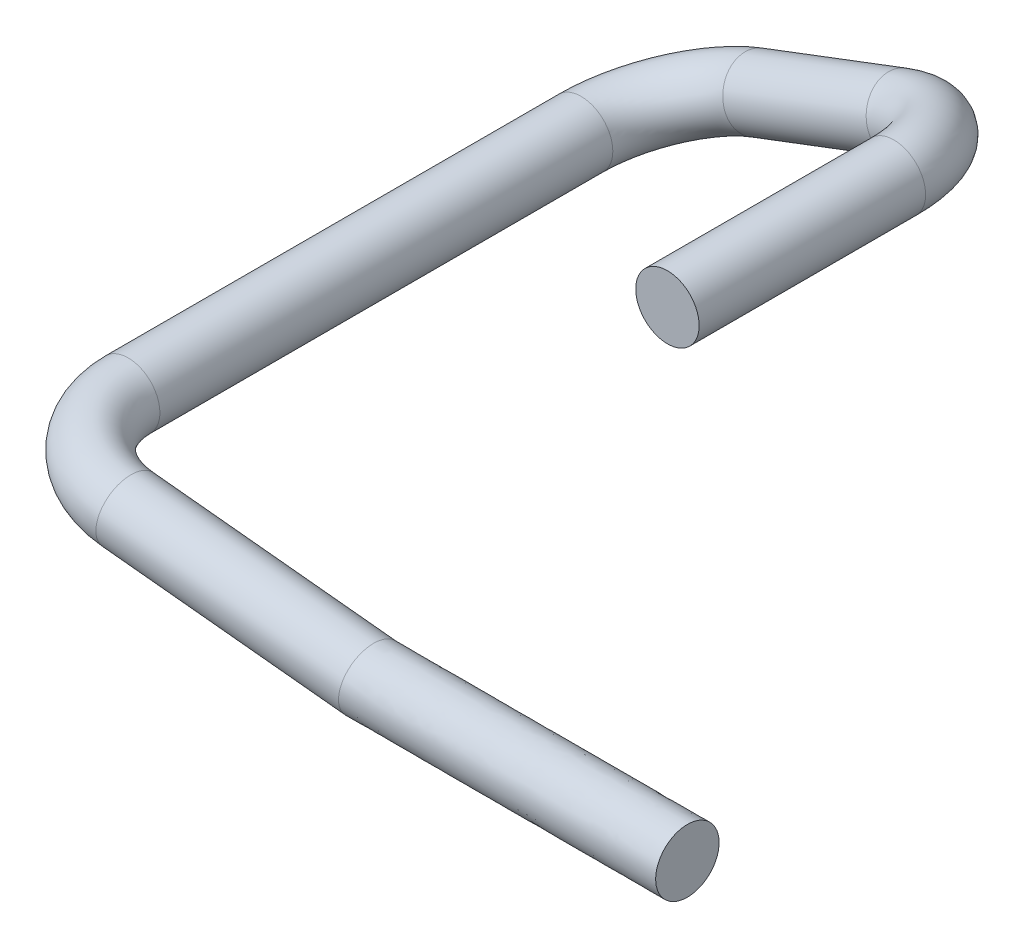
ISO-10303-21;
HEADER;
FILE_DESCRIPTION(('STEP AP214'),'2;1');
FILE_NAME('part.step','',(''),(''),'','','');
FILE_SCHEMA(('AUTOMOTIVE_DESIGN { 1 0 10303 214 1 1 1 1 }'));
ENDSEC;
DATA;
#1=APPLICATION_CONTEXT('core data for automotive mechanical design processes');
#2=APPLICATION_PROTOCOL_DEFINITION('international standard','automotive_design',2000,#1);
#3=PRODUCT_CONTEXT('',#1,'mechanical');
#4=PRODUCT('Part','Part','',(#3));
#5=PRODUCT_RELATED_PRODUCT_CATEGORY('part','',(#4));
#6=PRODUCT_DEFINITION_FORMATION('','',#4);
#7=PRODUCT_DEFINITION_CONTEXT('part definition',#1,'design');
#8=PRODUCT_DEFINITION('design','',#6,#7);
#9=PRODUCT_DEFINITION_SHAPE('','',#8);
#10=(LENGTH_UNIT() NAMED_UNIT(*) SI_UNIT(.MILLI.,.METRE.));
#11=(NAMED_UNIT(*) PLANE_ANGLE_UNIT() SI_UNIT($,.RADIAN.));
#12=(NAMED_UNIT(*) SI_UNIT($,.STERADIAN.) SOLID_ANGLE_UNIT());
#13=UNCERTAINTY_MEASURE_WITH_UNIT(LENGTH_MEASURE(1.E-05),#10,'distance_accuracy_value','');
#14=(GEOMETRIC_REPRESENTATION_CONTEXT(3) GLOBAL_UNCERTAINTY_ASSIGNED_CONTEXT((#13)) GLOBAL_UNIT_ASSIGNED_CONTEXT((#10,
#11,#12)) REPRESENTATION_CONTEXT('',''));
#15=CARTESIAN_POINT('',(0.,0.,0.));
#16=DIRECTION('',(0.,0.,1.));
#17=DIRECTION('',(1.,0.,0.));
#18=AXIS2_PLACEMENT_3D('',#15,#16,#17);
#19=CARTESIAN_POINT('',(2.82561785491536,0.371999647827147,0.));
#20=DIRECTION('',(0.,0.,1.));
#21=DIRECTION('',(1.,0.,0.));
#22=AXIS2_PLACEMENT_3D('',#19,#20,#21);
#23=CYLINDRICAL_SURFACE('',#22,0.35);
#24=CARTESIAN_POINT('',(2.82561785491536,0.371999647827147,2.5));
#25=DIRECTION('',(0.,0.,1.));
#26=DIRECTION('',(1.,0.,0.));
#27=AXIS2_PLACEMENT_3D('',#24,#25,#26);
#28=CIRCLE('',#27,0.35);
#29=CARTESIAN_POINT('',(2.47561785491536,0.371999647827147,2.5));
#30=VERTEX_POINT('',#29);
#31=CARTESIAN_POINT('',(3.17383780794161,0.33674536703182,2.5));
#32=VERTEX_POINT('',#31);
#33=EDGE_CURVE('E27',#30,#32,#28,.T.);
#34=ORIENTED_EDGE('',*,*,#33,.F.);
#35=DIRECTION('',(0.,0.,-1.));
#36=VECTOR('',#35,1.);
#37=CARTESIAN_POINT('',(2.47561785491536,0.371999647827147,0.));
#38=LINE('',#37,#36);
#39=CARTESIAN_POINT('',(2.47561785491536,0.371999647827147,-2.5));
#40=VERTEX_POINT('',#39);
#41=EDGE_CURVE('E11',#30,#40,#38,.T.);
#42=ORIENTED_EDGE('',*,*,#41,.T.);
#43=CARTESIAN_POINT('',(2.82561785491536,0.371999647827147,-2.5));
#44=DIRECTION('',(0.,0.,-1.));
#45=DIRECTION('',(1.,0.,0.));
#46=AXIS2_PLACEMENT_3D('',#43,#44,#45);
#47=CIRCLE('',#46,0.35);
#48=CARTESIAN_POINT('',(3.15284802148136,0.496178623862499,-2.5));
#49=VERTEX_POINT('',#48);
#50=EDGE_CURVE('E133',#49,#40,#47,.T.);
#51=ORIENTED_EDGE('',*,*,#50,.F.);
#52=CARTESIAN_POINT('',(2.82561785491536,0.371999647827147,-2.5));
#53=DIRECTION('',(0.,0.,-1.));
#54=DIRECTION('',(1.,0.,0.));
#55=AXIS2_PLACEMENT_3D('',#52,#53,#54);
#56=CIRCLE('',#55,0.35);
#57=EDGE_CURVE('E127',#40,#49,#56,.T.);
#58=ORIENTED_EDGE('',*,*,#57,.F.);
#59=ORIENTED_EDGE('',*,*,#41,.F.);
#60=CARTESIAN_POINT('',(2.82561785491536,0.371999647827147,2.5));
#61=DIRECTION('',(0.,0.,1.));
#62=DIRECTION('',(1.,0.,0.));
#63=AXIS2_PLACEMENT_3D('',#60,#61,#62);
#64=CIRCLE('',#63,0.35);
#65=EDGE_CURVE('E245',#32,#30,#64,.T.);
#66=ORIENTED_EDGE('',*,*,#65,.F.);
#67=EDGE_LOOP('',(#34,#42,#51,#58,#59,#66));
#68=FACE_BOUND('',#67,.T.);
#69=ADVANCED_FACE('F17',(#68),#23,.T.);
#70=CARTESIAN_POINT('',(3.82053200641893,0.271273131269069,2.5));
#71=DIRECTION('',(0.100726516558078,0.994914151503573,0.));
#72=DIRECTION('',(0.,0.,1.));
#73=AXIS2_PLACEMENT_3D('',#70,#71,#72);
#74=TOROIDAL_SURFACE('',#73,1.,0.35);
#75=CARTESIAN_POINT('',(3.82053200641893,0.271273131269069,3.5));
#76=DIRECTION('',(0.994914151503573,-0.100726516558078,0.));
#77=DIRECTION('',(0.0101458311379242,0.100214236755291,-0.994914151503573));
#78=AXIS2_PLACEMENT_3D('',#75,#76,#77);
#79=CIRCLE('',#78,0.35);
#80=CARTESIAN_POINT('',(3.81698096552066,0.236198148404717,3.84821995302625));
#81=VERTEX_POINT('',#80);
#82=CARTESIAN_POINT('',(3.82053200641893,0.271273131269069,3.15));
#83=VERTEX_POINT('',#82);
#84=EDGE_CURVE('E112',#81,#83,#79,.T.);
#85=ORIENTED_EDGE('',*,*,#84,.F.);
#86=CARTESIAN_POINT('',(3.82053200641893,0.271273131269069,3.5));
#87=DIRECTION('',(0.994914151503573,-0.100726516558078,0.));
#88=DIRECTION('',(0.0101458311379242,0.100214236755291,-0.994914151503573));
#89=AXIS2_PLACEMENT_3D('',#86,#87,#88);
#90=CIRCLE('',#89,0.35);
#91=EDGE_CURVE('E106',#83,#81,#90,.T.);
#92=ORIENTED_EDGE('',*,*,#91,.F.);
#93=CARTESIAN_POINT('',(3.82053200641893,0.271273131269069,2.5));
#94=DIRECTION('',(-0.100726516558078,-0.994914151503573,0.));
#95=DIRECTION('',(0.,0.,1.));
#96=AXIS2_PLACEMENT_3D('',#93,#94,#95);
#97=CIRCLE('',#96,0.65);
#98=EDGE_CURVE('E116',#83,#32,#97,.T.);
#99=ORIENTED_EDGE('',*,*,#98,.T.);
#100=ORIENTED_EDGE('',*,*,#65,.T.);
#101=ORIENTED_EDGE('',*,*,#33,.T.);
#102=ORIENTED_EDGE('',*,*,#98,.F.);
#103=EDGE_LOOP('',(#85,#92,#99,#100,#101,#102));
#104=FACE_BOUND('',#103,.T.);
#105=ADVANCED_FACE('F118',(#104),#74,.T.);
#106=CARTESIAN_POINT('',(3.82053200641893,0.271273131269069,3.5));
#107=DIRECTION('',(0.994914151503573,-0.100726516558078,0.));
#108=DIRECTION('',(0.0101458311379248,0.100214236755291,-0.994914151503573));
#109=AXIS2_PLACEMENT_3D('',#106,#107,#108);
#110=CYLINDRICAL_SURFACE('',#109,0.35);
#111=CARTESIAN_POINT('',(6.49444622487397,-0.0348742834519973,3.8482403169612));
#112=CARTESIAN_POINT('',(6.4938040175921,-0.041217845912004,3.84759873445029));
#113=CARTESIAN_POINT('',(6.49316909707066,-0.0475443530300619,3.84678160052662));
#114=CARTESIAN_POINT('',(6.49192566843393,-0.0600148642428641,3.8448197683799));
#115=CARTESIAN_POINT('',(6.49131688569275,-0.0661599515488844,3.84368212574055));
#116=CARTESIAN_POINT('',(6.49012571890267,-0.0782349929908504,3.84110719524966));
#117=CARTESIAN_POINT('',(6.48954305154493,-0.0841665822747904,3.83967770247851));
#118=CARTESIAN_POINT('',(6.48840412699763,-0.0957865484684334,3.83655079245845));
#119=CARTESIAN_POINT('',(6.487847582787,-0.101477148503375,3.83486173693158));
#120=CARTESIAN_POINT('',(6.48676090365614,-0.112591869097916,3.83124995440257));
#121=CARTESIAN_POINT('',(6.48623048234115,-0.118018809026919,3.82933598576789));
#122=CARTESIAN_POINT('',(6.48519604735751,-0.128587900372385,3.82531035243094));
#123=CARTESIAN_POINT('',(6.48469175050519,-0.133733447875792,3.82320767277353));
#124=CARTESIAN_POINT('',(6.48370956083992,-0.143726349058913,3.81884141684726));
#125=CARTESIAN_POINT('',(6.48323138925326,-0.148577632052923,3.81658689232702));
#126=CARTESIAN_POINT('',(6.48230144661098,-0.157973295614763,3.81195377174717));
#127=CARTESIAN_POINT('',(6.48184940096215,-0.162522075491932,3.80958414858867));
#128=CARTESIAN_POINT('',(6.48097170783383,-0.171308382995332,3.80475696991455));
#129=CARTESIAN_POINT('',(6.48054578837469,-0.175550701944002,3.80230818133307));
#130=CARTESIAN_POINT('',(6.47972034797682,-0.183723660607374,3.79735752780426));
#131=CARTESIAN_POINT('',(6.47932055478795,-0.187659395979348,3.79486411720736));
#132=CARTESIAN_POINT('',(6.47854737022111,-0.195222181019572,3.78985731433302));
#133=CARTESIAN_POINT('',(6.47817370219362,-0.198854538079266,3.7873519784425));
#134=CARTESIAN_POINT('',(6.47745277877271,-0.205816440197623,3.78235230168212));
#135=CARTESIAN_POINT('',(6.47710523667473,-0.209151411139725,3.77986555450358));
#136=CARTESIAN_POINT('',(6.47643657327407,-0.215526747460814,3.77493166687112));
#137=CARTESIAN_POINT('',(6.47611514873348,-0.218572566601457,3.77249161210681));
#138=CARTESIAN_POINT('',(6.47549876669126,-0.224379589026819,3.76767722565044));
#139=CARTESIAN_POINT('',(6.47520347870216,-0.227146189417081,3.76530944280728));
#140=CARTESIAN_POINT('',(6.4746393235476,-0.232406068446843,3.76066313246186));
#141=CARTESIAN_POINT('',(6.47437009463675,-0.234904608047307,3.75839060525794));
#142=CARTESIAN_POINT('',(6.47385836510956,-0.239640379373105,3.7539558966771));
#143=CARTESIAN_POINT('',(6.4736154317949,-0.24188267302599,3.75179915845673));
#144=CARTESIAN_POINT('',(6.47295666395159,-0.24794972548471,3.74580536654626));
#145=CARTESIAN_POINT('',(6.47254613257767,-0.25171558421922,3.74190768950608));
#146=CARTESIAN_POINT('',(6.47183842356536,-0.258332804508232,3.73473192317942));
#147=CARTESIAN_POINT('',(6.47153493680267,-0.261217126508932,3.73148471671102));
#148=CARTESIAN_POINT('',(6.47093709212308,-0.267041141694887,3.72467643137861));
#149=CARTESIAN_POINT('',(6.47064450200402,-0.269972952453192,3.72110844303014));
#150=CARTESIAN_POINT('',(6.47007170575564,-0.27569302445081,3.71385907597953));
#151=CARTESIAN_POINT('',(6.46979149799579,-0.278481304598303,3.71017771231567));
#152=CARTESIAN_POINT('',(6.46924837311995,-0.283908085483783,3.70271009430188));
#153=CARTESIAN_POINT('',(6.46898544043688,-0.286546720769295,3.69892393888082));
#154=CARTESIAN_POINT('',(6.46847556626744,-0.291668383884661,3.69125607260301));
#155=CARTESIAN_POINT('',(6.46822859842985,-0.294151667903334,3.68737453460157));
#156=CARTESIAN_POINT('',(6.4677510170294,-0.298957653197309,3.67952553883833));
#157=CARTESIAN_POINT('',(6.46752036452069,-0.301280736525537,3.67555831737881));
#158=CARTESIAN_POINT('',(6.46707533165142,-0.305762119853389,3.66754793438737));
#159=CARTESIAN_POINT('',(6.46686090087301,-0.307920930553603,3.66350506135539));
#160=CARTESIAN_POINT('',(6.46644834810894,-0.312070394063383,3.65535358382733));
#161=CARTESIAN_POINT('',(6.46625016409189,-0.314061687311753,3.6512453084707));
#162=CARTESIAN_POINT('',(6.46587010959047,-0.3178735715341,3.64297338923866));
#163=CARTESIAN_POINT('',(6.46568816573125,-0.319694932171341,3.63881010339588));
#164=CARTESIAN_POINT('',(6.46534060464335,-0.323165241166534,3.63043859488528));
#165=CARTESIAN_POINT('',(6.46517490278316,-0.324815086300216,3.62623074745856));
#166=CARTESIAN_POINT('',(6.46485983645324,-0.327941480566954,3.61778053509407));
#167=CARTESIAN_POINT('',(6.46471037619751,-0.329419049958815,3.61353855117666));
#168=CARTESIAN_POINT('',(6.46442780439516,-0.332200818727334,3.60503039358424));
#169=CARTESIAN_POINT('',(6.46429458596424,-0.33350615679665,3.60076459572951));
#170=CARTESIAN_POINT('',(6.46404450892196,-0.335944173286385,3.59221897137032));
#171=CARTESIAN_POINT('',(6.46392753236046,-0.337078102492272,3.58793950512647));
#172=CARTESIAN_POINT('',(6.46370995031732,-0.339174762944029,3.5793764682106));
#173=CARTESIAN_POINT('',(6.46360921582428,-0.340138849583427,3.57509323264806));
#174=CARTESIAN_POINT('',(6.46342412881377,-0.341897997955431,3.5665322799335));
#175=CARTESIAN_POINT('',(6.46333963621074,-0.342694511225913,3.56225486403895));
#176=CARTESIAN_POINT('',(6.46318704532128,-0.344121351430307,3.55371481412202));
#177=CARTESIAN_POINT('',(6.4631187958276,-0.344753216779161,3.54945243978934));
#178=CARTESIAN_POINT('',(6.46299869841169,-0.345854214504068,3.54095132576792));
#179=CARTESIAN_POINT('',(6.46294668816414,-0.346324962282472,3.53671279754045));
#180=CARTESIAN_POINT('',(6.46285909546425,-0.34710773859174,3.52826777475268));
#181=CARTESIAN_POINT('',(6.46282333930947,-0.347421449180953,3.52406143784953));
#182=CARTESIAN_POINT('',(6.46276821168896,-0.347894667768162,3.51568870379816));
#183=CARTESIAN_POINT('',(6.46274865586316,-0.348055913887592,3.51152240606566));
#184=CARTESIAN_POINT('',(6.46272611350869,-0.348229372404515,3.5032272279811));
#185=CARTESIAN_POINT('',(6.4627229676216,-0.34824301954943,3.49909837796796));
#186=CARTESIAN_POINT('',(6.46273267327943,-0.348124304551514,3.49079563048438));
#187=CARTESIAN_POINT('',(6.46274570787086,-0.347990273698504,3.48662175687491));
#188=CARTESIAN_POINT('',(6.46278744194271,-0.347582135799177,3.47845014985177));
#189=CARTESIAN_POINT('',(6.46281548676068,-0.347313911342329,3.47445211788046));
#190=CARTESIAN_POINT('',(6.46288777438417,-0.346636229810314,3.46641050058441));
#191=CARTESIAN_POINT('',(6.46293224341643,-0.346224805091703,3.46236708288242));
#192=CARTESIAN_POINT('',(6.46303708504405,-0.345255463358479,3.45424143236498));
#193=CARTESIAN_POINT('',(6.46309766867506,-0.344695602778111,3.45015943410384));
#194=CARTESIAN_POINT('',(6.46323483358748,-0.343424474848665,3.44196389878833));
#195=CARTESIAN_POINT('',(6.46331161631592,-0.342711298564932,3.43785066110016));
#196=CARTESIAN_POINT('',(6.46348116707932,-0.341129030519605,3.4296004648419));
#197=CARTESIAN_POINT('',(6.46357412558334,-0.340258075230898,3.4254638675205));
#198=CARTESIAN_POINT('',(6.46377604458755,-0.33835620713514,3.41717528411226));
#199=CARTESIAN_POINT('',(6.46388518503232,-0.337323487060663,3.41302371703247));
#200=CARTESIAN_POINT('',(6.46411947659545,-0.335094574473539,3.40471401191597));
#201=CARTESIAN_POINT('',(6.46424479710182,-0.33389664171926,3.40055634537858));
#202=CARTESIAN_POINT('',(6.46451145958606,-0.33133437492584,3.39224370676262));
#203=CARTESIAN_POINT('',(6.46465296048101,-0.329968378175245,3.38808925223308));
#204=CARTESIAN_POINT('',(6.46495199390947,-0.327067696995431,3.37979270519064));
#205=CARTESIAN_POINT('',(6.4651096749292,-0.325531437441982,3.37565116867742));
#206=CARTESIAN_POINT('',(6.46544107891556,-0.322288639389515,3.3673904740116));
#207=CARTESIAN_POINT('',(6.46561493996827,-0.320580622771714,3.36327190159422));
#208=CARTESIAN_POINT('',(6.46597871428704,-0.316993462268818,3.35506743945708));
#209=CARTESIAN_POINT('',(6.46616875524518,-0.315112945857388,3.35098215544907));
#210=CARTESIAN_POINT('',(6.46656489968314,-0.311180722207843,3.3428547946553));
#211=CARTESIAN_POINT('',(6.46677112044105,-0.309127755603709,3.33881333285703));
#212=CARTESIAN_POINT('',(6.46719963484107,-0.304851387504508,3.33078428707086));
#213=CARTESIAN_POINT('',(6.46742203529646,-0.302626846174998,3.32679731583626));
#214=CARTESIAN_POINT('',(6.46788291955903,-0.298008930627916,3.31888798819138));
#215=CARTESIAN_POINT('',(6.46812149962999,-0.295614541120536,3.31496623014216));
#216=CARTESIAN_POINT('',(6.46861475368538,-0.290659395009418,3.30719804838665));
#217=CARTESIAN_POINT('',(6.46886951326236,-0.288097751177357,3.30335219603157));
#218=CARTESIAN_POINT('',(6.46939513720142,-0.282811433301777,3.29574643997293));
#219=CARTESIAN_POINT('',(6.46966607632532,-0.280086001996946,3.29198706774041));
#220=CARTESIAN_POINT('',(6.47022406991608,-0.274476316521232,3.28456469354658));
#221=CARTESIAN_POINT('',(6.47051118811149,-0.27159143528315,3.28090217029112));
#222=CARTESIAN_POINT('',(6.47110155262475,-0.265667907326929,3.27368362709157));
#223=CARTESIAN_POINT('',(6.47140485140509,-0.262628762204313,3.27012802039473));
#224=CARTESIAN_POINT('',(6.47202758276543,-0.256402616688177,3.26313308991639));
#225=CARTESIAN_POINT('',(6.47234705623991,-0.253215243373426,3.2596941017661));
#226=CARTESIAN_POINT('',(6.47300217070536,-0.246699268846116,3.25294166003596));
#227=CARTESIAN_POINT('',(6.47333784076642,-0.243370415080546,3.24962845280647));
#228=CARTESIAN_POINT('',(6.47395010868162,-0.237321768005303,3.24384642479098));
#229=CARTESIAN_POINT('',(6.4742236538061,-0.23462718848847,3.24135083400002));
#230=CARTESIAN_POINT('',(6.47479261383978,-0.229028949204438,3.23632786548045));
#231=CARTESIAN_POINT('',(6.4750884468151,-0.226121478073214,3.23380477868682));
#232=CARTESIAN_POINT('',(6.47570202622822,-0.220091344042679,3.22874443492547));
#233=CARTESIAN_POINT('',(6.47602015795689,-0.216964902436884,3.22621172733852));
#234=CARTESIAN_POINT('',(6.47667836155948,-0.210491889049993,3.22115106789901));
#235=CARTESIAN_POINT('',(6.47701879105212,-0.207141610768208,3.21862790199498));
#236=CARTESIAN_POINT('',(6.47772161483824,-0.200217480695908,3.21360654056714));
#237=CARTESIAN_POINT('',(6.47808434394494,-0.196640038762876,3.21111334145595));
#238=CARTESIAN_POINT('',(6.47883178669599,-0.189259850690937,3.20617325469104));
#239=CARTESIAN_POINT('',(6.47921681623852,-0.185453673577997,3.20373153850899));
#240=CARTESIAN_POINT('',(6.48000887554957,-0.177616316293346,3.19891674161043));
#241=CARTESIAN_POINT('',(6.48041620546114,-0.173581908634287,3.19654896507724));
#242=CARTESIAN_POINT('',(6.48125288179747,-0.165290379100913,3.19190499208075));
#243=CARTESIAN_POINT('',(6.48168251519713,-0.161030265530932,3.18963417737558));
#244=CARTESIAN_POINT('',(6.48233870932455,-0.154524495249807,3.18633843943344));
#245=CARTESIAN_POINT('',(6.48256189010947,-0.152311937441856,3.18524704175552));
#246=CARTESIAN_POINT('',(6.48301373698951,-0.147832911524028,3.18309664689251));
#247=CARTESIAN_POINT('',(6.48324243605304,-0.145566123198463,3.18203832383973));
#248=CARTESIAN_POINT('',(6.48394175738693,-0.138641312641596,3.17889592279425));
#249=CARTESIAN_POINT('',(6.48441662879961,-0.133948066852787,3.1768896920219));
#250=CARTESIAN_POINT('',(6.4852937897705,-0.125270002295605,3.17340422210781));
#251=CARTESIAN_POINT('',(6.48569494686084,-0.12129786550196,3.17189294369816));
#252=CARTESIAN_POINT('',(6.48647760495951,-0.113522698713065,3.16909705915838));
#253=CARTESIAN_POINT('',(6.48685896242143,-0.109722505293878,3.16780453069282));
#254=CARTESIAN_POINT('',(6.48760278013424,-0.102301388838427,3.16542328104954));
#255=CARTESIAN_POINT('',(6.4879650542817,-0.0986828442826096,3.16432708870025));
#256=CARTESIAN_POINT('',(6.48867050387975,-0.0916327688694606,3.16231656344417));
#257=CARTESIAN_POINT('',(6.48901350497687,-0.0882032071005391,3.16139523283965));
#258=CARTESIAN_POINT('',(6.48998147422552,-0.0785276043573712,3.15895467527021));
#259=CARTESIAN_POINT('',(6.49060972640248,-0.0722510139882625,3.15755585387234));
#260=CARTESIAN_POINT('',(6.49179062437925,-0.0604871396814815,3.15527549767221));
#261=CARTESIAN_POINT('',(6.49234196934076,-0.0550082469312528,3.15434953774645));
#262=CARTESIAN_POINT('',(6.49336894794157,-0.0448452398610048,3.15288224890994));
#263=CARTESIAN_POINT('',(6.4938434107935,-0.0401663411262669,3.15230391674045));
#264=CARTESIAN_POINT('',(6.49471649589546,-0.0315968371569257,3.1514217660063));
#265=CARTESIAN_POINT('',(6.49511411106898,-0.0277092083938857,3.15108782740657));
#266=CARTESIAN_POINT('',(6.49583311215864,-0.0207088983429953,3.15060544824155));
#267=CARTESIAN_POINT('',(6.49615372956075,-0.0175977668428175,3.15043319781102));
#268=CARTESIAN_POINT('',(6.49671899761657,-0.0121350297824264,3.15020460132715));
#269=CARTESIAN_POINT('',(6.49696301343071,-0.00978410143431615,3.15013019739944));
#270=CARTESIAN_POINT('',(6.49746402241552,-0.00495553104904608,3.1500265827687));
#271=CARTESIAN_POINT('',(6.49772101214669,-0.00247783206121613,3.15000000000479));
#272=CARTESIAN_POINT('',(6.49797694668091,0.,3.15));
#273=B_SPLINE_CURVE_WITH_KNOTS('',3,(#111,#112,#113,#114,#115,#116,#117,#118,#119,#120,#121,
#122,#123,#124,#125,#126,#127,#128,#129,#130,#131,#132,#133,#134,#135,#136,#137,#138,#139,#140,
#141,#142,#143,#144,#145,#146,#147,#148,#149,#150,#151,#152,#153,#154,#155,#156,#157,#158,#159,
#160,#161,#162,#163,#164,#165,#166,#167,#168,#169,#170,#171,#172,#173,#174,#175,#176,#177,#178,
#179,#180,#181,#182,#183,#184,#185,#186,#187,#188,#189,#190,#191,#192,#193,#194,#195,#196,#197,
#198,#199,#200,#201,#202,#203,#204,#205,#206,#207,#208,#209,#210,#211,#212,#213,#214,#215,#216,
#217,#218,#219,#220,#221,#222,#223,#224,#225,#226,#227,#228,#229,#230,#231,#232,#233,#234,#235,
#236,#237,#238,#239,#240,#241,#242,#243,#244,#245,#246,#247,#248,#249,#250,#251,#252,#253,#254,
#255,#256,#257,#258,#259,#260,#261,#262,#263,#264,#265,#266,#267,#268,#269,#270,#271,#272),
.UNSPECIFIED.,.F.,.F.,(4,2,2,2,2,2,2,2,2,2,2,2,2,2,2,2,2,2,2,2,2,2,2,2,2,2,2,2,2,2,2,2,2,2,2,2,
2,2,2,2,2,2,2,2,2,2,2,2,2,2,2,2,2,2,2,2,2,2,2,2,2,2,2,2,2,2,2,2,2,2,2,2,2,2,2,2,2,2,2,2,4),(0.,
0.0192220608409671,0.0380502230232248,0.0564292577086098,0.0743075013097231,0.0916372678449706,
0.108375137855091,0.124482124897567,0.139923725899195,0.154669865912277,0.16869475092742,
0.181976644313973,0.194497583262839,0.206243051450019,0.217201623224743,0.227364593174494,
0.236725603148491,0.25302476631433,0.266083392056911,0.279961436795997,0.293837648590442,
0.307701179592942,0.321541210488103,0.335347003890931,0.349107956840688,0.362813651773597,
0.376453905389374,0.390018814870663,0.403498800970052,0.416884647544204,0.430167537186762,
0.443339082688695,0.456391354134317,0.469316901520755,0.482108772866249,0.494760527846116,
0.507266247062812,0.519650292922027,0.532175722630921,0.544194730611618,0.556385868344863,
0.568745272989505,0.581268537984132,0.593950705657921,0.606786263459681,0.619769144135166,
0.632892730146337,0.646149862579812,0.659532854735516,0.673033510521212,0.686643147705211,
0.700352625999761,0.714152379863041,0.728032455820816,0.741982554021836,0.755992073656803,
0.77005016179169,0.784145765095081,0.798267683878289,0.809314573362711,0.820895254801244,
0.833001279856119,0.845622312876178,0.858745986850917,0.872357776387512,0.886440893013988,
0.900976208176006,0.908407229792611,0.915943064638307,0.931315848112435,0.944119600033514,
0.956213364611039,0.967606046476552,0.978307719971846,0.997680339375608,1.01442579366193,
1.02863679868384,1.04040104892662,1.04979695572039,1.05689067621224,1.06436352890226),.UNSPECIFIED.);
#274=CARTESIAN_POINT('',(6.49847757862327,-5.06846660166405E-05,3.1500000296602));
#275=VERTEX_POINT('',#274);
#276=CARTESIAN_POINT('',(6.49444622487397,-0.0348742834519972,3.84824031696121));
#277=VERTEX_POINT('',#276);
#278=EDGE_CURVE('E123',#275,#277,#273,.F.);
#279=ORIENTED_EDGE('',*,*,#278,.T.);
#280=DIRECTION('',(-0.994914151503573,0.100726516558078,0.));
#281=VECTOR('',#280,1.);
#282=CARTESIAN_POINT('',(3.81698096552066,0.236198148404717,3.84821995302625));
#283=LINE('',#282,#281);
#284=EDGE_CURVE('E111',#277,#81,#283,.T.);
#285=ORIENTED_EDGE('',*,*,#284,.T.);
#286=ORIENTED_EDGE('',*,*,#84,.T.);
#287=ORIENTED_EDGE('',*,*,#91,.T.);
#288=ORIENTED_EDGE('',*,*,#284,.F.);
#289=CARTESIAN_POINT('',(6.49798720945842,0.000101369372248948,3.84999998516989));
#290=CARTESIAN_POINT('',(6.49783929679029,-0.00133337698374426,3.85000040549921));
#291=CARTESIAN_POINT('',(6.49769175837971,-0.0027681645822675,3.84999191224552));
#292=CARTESIAN_POINT('',(6.49739667792161,-0.00564477829694018,3.8499570123091));
#293=CARTESIAN_POINT('',(6.49724913955047,-0.00708660370569496,3.84993051619773));
#294=CARTESIAN_POINT('',(6.49695405931505,-0.00997701387855608,3.84985934411433));
#295=CARTESIAN_POINT('',(6.49680652104099,-0.0114255968120776,3.84981457889412));
#296=CARTESIAN_POINT('',(6.4965114409637,-0.0143292293699089,3.84970660745909));
#297=CARTESIAN_POINT('',(6.49636390265904,-0.0157842760424659,3.84964331228995));
#298=CARTESIAN_POINT('',(6.49606882264513,-0.0187005340523236,3.84949802450097));
#299=CARTESIAN_POINT('',(6.49592128434323,-0.0201617413207498,3.8494159432798));
#300=CARTESIAN_POINT('',(6.49562620442088,-0.0230900091646581,3.84923283231507));
#301=CARTESIAN_POINT('',(6.49547866611605,-0.0245570645602108,3.84913171438484));
#302=CARTESIAN_POINT('',(6.4951835862681,-0.0274967080067987,3.84891028430477));
#303=CARTESIAN_POINT('',(6.49503604794859,-0.0289692897749729,3.84878988444364));
#304=CARTESIAN_POINT('',(6.49474096821549,-0.031919656193312,3.84852965167709));
#305=CARTESIAN_POINT('',(6.49459342993364,-0.0333974334684803,3.84838973160244));
#306=CARTESIAN_POINT('',(6.49444622487398,-0.0348742834519972,3.8482403169612));
#307=B_SPLINE_CURVE_WITH_KNOTS('',3,(#289,#290,#291,#292,#293,#294,#295,#296,#297,#298,#299,
#300,#301,#302,#303,#304,#305,#306),.UNSPECIFIED.,.F.,.F.,(4,2,2,2,2,2,2,2,4),(0.,
0.00432702455161455,0.00867570214429549,0.0130458831383831,0.0174373974897941,
0.0218500668311466,0.0262837044009512,0.0307381149784907,0.0352130948246475),.UNSPECIFIED.);
#308=CARTESIAN_POINT('',(6.49798720945842,0.000101369372202741,3.8499999851699));
#309=VERTEX_POINT('',#308);
#310=EDGE_CURVE('E186',#277,#309,#307,.F.);
#311=ORIENTED_EDGE('',*,*,#310,.T.);
#312=CARTESIAN_POINT('',(6.5,0.,3.5));
#313=DIRECTION('',(0.0502988552077209,0.998734211472098,0.));
#314=DIRECTION('',(0.998734211472098,-0.0502988552077209,0.));
#315=AXIS2_PLACEMENT_3D('',#312,#313,#314);
#316=ELLIPSE('',#315,6.92301945219617,0.35);
#317=CARTESIAN_POINT('',(6.5,0.,3.85));
#318=VERTEX_POINT('',#317);
#319=EDGE_CURVE('E143',#309,#318,#316,.T.);
#320=ORIENTED_EDGE('',*,*,#319,.T.);
#321=CARTESIAN_POINT('',(6.5,0.,3.5));
#322=DIRECTION('',(0.994914151503573,-0.100726516558078,0.));
#323=DIRECTION('',(0.0101458311379242,0.100214236755291,-0.994914151503573));
#324=AXIS2_PLACEMENT_3D('',#321,#322,#323);
#325=CIRCLE('',#324,0.35);
#326=EDGE_CURVE('E139',#275,#318,#325,.T.);
#327=ORIENTED_EDGE('',*,*,#326,.F.);
#328=EDGE_LOOP('',(#279,#285,#286,#287,#288,#311,#320,#327));
#329=FACE_BOUND('',#328,.T.);
#330=ADVANCED_FACE('F109',(#329),#110,.T.);
#331=CARTESIAN_POINT('',(6.27851787087894,1.68232379316639,0.));
#332=DIRECTION('',(0.,0.,-1.));
#333=DIRECTION('',(0.,-1.,0.));
#334=AXIS2_PLACEMENT_3D('',#331,#332,#333);
#335=PLANE('',#334);
#336=CARTESIAN_POINT('',(6.27851787087895,1.68232379316639,0.));
#337=DIRECTION('',(0.,0.,1.));
#338=DIRECTION('',(-0.748238072013248,-0.663430318563975,0.));
#339=AXIS2_PLACEMENT_3D('',#336,#337,#338);
#340=CIRCLE('',#339,0.35);
#341=CARTESIAN_POINT('',(6.54040119608359,1.91452440466378,0.));
#342=VERTEX_POINT('',#341);
#343=EDGE_CURVE('E280',#342,#342,#340,.T.);
#344=ORIENTED_EDGE('',*,*,#343,.T.);
#345=EDGE_LOOP('',(#344));
#346=FACE_BOUND('',#345,.T.);
#347=ADVANCED_FACE('F170',(#346),#335,.F.);
#348=CARTESIAN_POINT('',(3.76056118796107,0.726796722213868,-2.5));
#349=DIRECTION('',(0.35479707438672,-0.934943333045712,0.));
#350=DIRECTION('',(0.,0.,-1.));
#351=AXIS2_PLACEMENT_3D('',#348,#349,#350);
#352=TOROIDAL_SURFACE('',#351,1.,0.35);
#353=CARTESIAN_POINT('',(3.76056118796108,0.726796722213868,-3.5));
#354=DIRECTION('',(0.934943333045711,0.354797074386721,0.));
#355=DIRECTION('',(0.125880963993376,-0.331715159281988,0.934943333045711));
#356=AXIS2_PLACEMENT_3D('',#353,#354,#355);
#357=CIRCLE('',#356,0.35);
#358=CARTESIAN_POINT('',(3.71650285056339,0.842897027962564,-3.827230166566));
#359=VERTEX_POINT('',#358);
#360=CARTESIAN_POINT('',(3.76056118796108,0.726796722213868,-3.15));
#361=VERTEX_POINT('',#360);
#362=EDGE_CURVE('E266',#359,#361,#357,.T.);
#363=ORIENTED_EDGE('',*,*,#362,.F.);
#364=CARTESIAN_POINT('',(3.76056118796108,0.726796722213868,-3.5));
#365=DIRECTION('',(0.934943333045711,0.354797074386721,0.));
#366=DIRECTION('',(0.125880963993376,-0.331715159281988,0.934943333045711));
#367=AXIS2_PLACEMENT_3D('',#364,#365,#366);
#368=CIRCLE('',#367,0.35);
#369=EDGE_CURVE('E261',#361,#359,#368,.T.);
#370=ORIENTED_EDGE('',*,*,#369,.F.);
#371=CARTESIAN_POINT('',(3.76056118796107,0.726796722213868,-2.5));
#372=DIRECTION('',(-0.35479707438672,0.934943333045712,0.));
#373=DIRECTION('',(0.,0.,-1.));
#374=AXIS2_PLACEMENT_3D('',#371,#372,#373);
#375=CIRCLE('',#374,0.65);
#376=EDGE_CURVE('E257',#361,#49,#375,.T.);
#377=ORIENTED_EDGE('',*,*,#376,.T.);
#378=ORIENTED_EDGE('',*,*,#50,.T.);
#379=ORIENTED_EDGE('',*,*,#57,.T.);
#380=ORIENTED_EDGE('',*,*,#376,.F.);
#381=EDGE_LOOP('',(#363,#370,#377,#378,#379,#380));
#382=FACE_BOUND('',#381,.T.);
#383=ADVANCED_FACE('F202',(#382),#352,.T.);
#384=CARTESIAN_POINT('',(3.76056118796108,0.726796722213868,-3.5));
#385=DIRECTION('',(0.934943333045711,0.354797074386721,0.));
#386=DIRECTION('',(0.125880963993376,-0.331715159281987,0.934943333045712));
#387=AXIS2_PLACEMENT_3D('',#384,#385,#386);
#388=CYLINDRICAL_SURFACE('',#387,0.35);
#389=CARTESIAN_POINT('',(5.34357453783324,1.32752671877967,-3.5));
#390=DIRECTION('',(0.934943333045711,0.354797074386721,0.));
#391=DIRECTION('',(0.125880963993376,-0.331715159281988,0.934943333045711));
#392=AXIS2_PLACEMENT_3D('',#389,#390,#391);
#393=CIRCLE('',#392,0.35);
#394=CARTESIAN_POINT('',(5.29951620043556,1.44362702452836,-3.827230166566));
#395=VERTEX_POINT('',#394);
#396=CARTESIAN_POINT('',(5.34357453783324,1.32752671877967,-3.15));
#397=VERTEX_POINT('',#396);
#398=EDGE_CURVE('E267',#395,#397,#393,.T.);
#399=ORIENTED_EDGE('',*,*,#398,.F.);
#400=DIRECTION('',(-0.934943333045711,-0.354797074386721,0.));
#401=VECTOR('',#400,1.);
#402=CARTESIAN_POINT('',(3.71650285056339,0.842897027962564,-3.827230166566));
#403=LINE('',#402,#401);
#404=EDGE_CURVE('E262',#395,#359,#403,.T.);
#405=ORIENTED_EDGE('',*,*,#404,.T.);
#406=ORIENTED_EDGE('',*,*,#362,.T.);
#407=ORIENTED_EDGE('',*,*,#369,.T.);
#408=ORIENTED_EDGE('',*,*,#404,.F.);
#409=CARTESIAN_POINT('',(5.34357453783324,1.32752671877967,-3.5));
#410=DIRECTION('',(0.934943333045711,0.354797074386721,0.));
#411=DIRECTION('',(0.125880963993376,-0.331715159281988,0.934943333045711));
#412=AXIS2_PLACEMENT_3D('',#409,#410,#411);
#413=CIRCLE('',#412,0.35);
#414=EDGE_CURVE('E270',#397,#395,#413,.T.);
#415=ORIENTED_EDGE('',*,*,#414,.F.);
#416=EDGE_LOOP('',(#399,#405,#406,#407,#408,#415));
#417=FACE_BOUND('',#416,.T.);
#418=ADVANCED_FACE('F218',(#417),#388,.T.);
#419=CARTESIAN_POINT('',(5.34357453783323,1.32752671877966,-2.5));
#420=DIRECTION('',(0.354797074386721,-0.934943333045711,0.));
#421=DIRECTION('',(0.,0.,-1.));
#422=AXIS2_PLACEMENT_3D('',#419,#420,#421);
#423=TOROIDAL_SURFACE('',#422,1.,0.35);
#424=CARTESIAN_POINT('',(6.27851787087895,1.68232379316639,-2.5));
#425=DIRECTION('',(0.,0.,1.));
#426=DIRECTION('',(-0.748238072013248,-0.663430318563975,0.));
#427=AXIS2_PLACEMENT_3D('',#424,#425,#426);
#428=CIRCLE('',#427,0.35);
#429=CARTESIAN_POINT('',(6.54040119608359,1.91452440466378,-2.5));
#430=VERTEX_POINT('',#429);
#431=CARTESIAN_POINT('',(5.95128770431295,1.55814481713103,-2.5));
#432=VERTEX_POINT('',#431);
#433=EDGE_CURVE('E279',#430,#432,#428,.T.);
#434=ORIENTED_EDGE('',*,*,#433,.F.);
#435=CARTESIAN_POINT('',(6.27851787087895,1.68232379316639,-2.5));
#436=DIRECTION('',(0.,0.,1.));
#437=DIRECTION('',(-0.748238072013248,-0.663430318563975,0.));
#438=AXIS2_PLACEMENT_3D('',#435,#436,#437);
#439=CIRCLE('',#438,0.35);
#440=EDGE_CURVE('E284',#432,#430,#439,.T.);
#441=ORIENTED_EDGE('',*,*,#440,.F.);
#442=CARTESIAN_POINT('',(5.34357453783323,1.32752671877966,-2.5));
#443=DIRECTION('',(-0.354797074386721,0.934943333045711,0.));
#444=DIRECTION('',(0.,0.,-1.));
#445=AXIS2_PLACEMENT_3D('',#442,#443,#444);
#446=CIRCLE('',#445,0.65);
#447=EDGE_CURVE('E274',#432,#397,#446,.T.);
#448=ORIENTED_EDGE('',*,*,#447,.T.);
#449=ORIENTED_EDGE('',*,*,#414,.T.);
#450=ORIENTED_EDGE('',*,*,#398,.T.);
#451=ORIENTED_EDGE('',*,*,#447,.F.);
#452=EDGE_LOOP('',(#434,#441,#448,#449,#450,#451));
#453=FACE_BOUND('',#452,.T.);
#454=ADVANCED_FACE('F220',(#453),#423,.T.);
#455=CARTESIAN_POINT('',(6.27851787087895,1.68232379316639,-2.5));
#456=DIRECTION('',(0.,0.,1.));
#457=DIRECTION('',(-0.748238072013248,-0.663430318563975,0.));
#458=AXIS2_PLACEMENT_3D('',#455,#456,#457);
#459=CYLINDRICAL_SURFACE('',#458,0.35);
#460=ORIENTED_EDGE('',*,*,#343,.F.);
#461=DIRECTION('',(0.,0.,-1.));
#462=VECTOR('',#461,1.);
#463=CARTESIAN_POINT('',(6.54040119608359,1.91452440466378,-2.5));
#464=LINE('',#463,#462);
#465=EDGE_CURVE('E275',#342,#430,#464,.T.);
#466=ORIENTED_EDGE('',*,*,#465,.T.);
#467=ORIENTED_EDGE('',*,*,#433,.T.);
#468=ORIENTED_EDGE('',*,*,#440,.T.);
#469=ORIENTED_EDGE('',*,*,#465,.F.);
#470=EDGE_LOOP('',(#460,#466,#467,#468,#469));
#471=FACE_BOUND('',#470,.T.);
#472=ADVANCED_FACE('F223',(#471),#459,.T.);
#473=CARTESIAN_POINT('',(9.99853230540907,0.505486251141968,3.5));
#474=DIRECTION('',(-1.,0.,0.));
#475=DIRECTION('',(0.,0.,1.));
#476=AXIS2_PLACEMENT_3D('',#473,#474,#475);
#477=PLANE('',#476);
#478=CARTESIAN_POINT('',(9.99853230540907,0.,3.5));
#479=DIRECTION('',(-1.,0.,0.));
#480=DIRECTION('',(0.,0.,1.));
#481=AXIS2_PLACEMENT_3D('',#478,#479,#480);
#482=ELLIPSE('',#481,0.35,0.34821995302625);
#483=CARTESIAN_POINT('',(9.99853230540907,0.,3.15));
#484=VERTEX_POINT('',#483);
#485=EDGE_CURVE('E144',#484,#484,#482,.T.);
#486=ORIENTED_EDGE('',*,*,#485,.F.);
#487=EDGE_LOOP('',(#486));
#488=FACE_BOUND('',#487,.T.);
#489=ADVANCED_FACE('F201',(#488),#477,.F.);
#490=CARTESIAN_POINT('',(6.45888659728723,0.,3.15));
#491=CARTESIAN_POINT('',(6.45888659728723,0.348219953026252,3.15));
#492=CARTESIAN_POINT('',(6.45888659728723,0.348219953026251,3.5));
#493=CARTESIAN_POINT('',(6.45888659728723,0.348219953026249,3.85));
#494=CARTESIAN_POINT('',(6.45888659728723,0.,3.85));
#495=CARTESIAN_POINT('',(6.45888659728723,-0.348219953026252,3.85));
#496=CARTESIAN_POINT('',(6.45888659728723,-0.34821995302625,3.5));
#497=CARTESIAN_POINT('',(6.45888659728723,-0.348219953026249,3.15));
#498=CARTESIAN_POINT('',(6.45888659728723,0.,3.15));
#499=CARTESIAN_POINT('',(9.99853230540907,0.,3.15));
#500=CARTESIAN_POINT('',(9.99853230540907,0.348219953026252,3.15));
#501=CARTESIAN_POINT('',(9.99853230540907,0.348219953026251,3.5));
#502=CARTESIAN_POINT('',(9.99853230540907,0.348219953026249,3.85));
#503=CARTESIAN_POINT('',(9.99853230540907,0.,3.85));
#504=CARTESIAN_POINT('',(9.99853230540907,-0.348219953026252,3.85));
#505=CARTESIAN_POINT('',(9.99853230540907,-0.34821995302625,3.5));
#506=CARTESIAN_POINT('',(9.99853230540907,-0.348219953026249,3.15));
#507=CARTESIAN_POINT('',(9.99853230540907,0.,3.15));
#508=(BOUNDED_SURFACE() B_SPLINE_SURFACE(1,2,((#490,#491,#492,#493,#494,#495,#496,#497,#498),
(#499,#500,#501,#502,#503,#504,#505,#506,#507)),.UNSPECIFIED.,.F.,.T.,
.F.) B_SPLINE_SURFACE_WITH_KNOTS((2,2),(3,2,2,2,3),(-0.117466864893625,9.99580658688307),
(-3.14159265358979,-1.5707963267949,0.,1.5707963267949,3.14159265358979),
.UNSPECIFIED.) GEOMETRIC_REPRESENTATION_ITEM() RATIONAL_B_SPLINE_SURFACE(((1.,0.707106781186548,
1.,0.707106781186548,1.,0.707106781186548,1.,0.707106781186548,1.),(1.,0.707106781186548,1.,
0.707106781186548,1.,0.707106781186548,1.,0.707106781186548,1.))) REPRESENTATION_ITEM('') SURFACE());
#509=CARTESIAN_POINT('',(9.99853230540907,0.,3.15));
#510=CARTESIAN_POINT('',(6.49797694668167,0.,3.15));
#511=(BOUNDED_CURVE() B_SPLINE_CURVE(1,(#509,#510),.UNSPECIFIED.,.F.,
.F.) B_SPLINE_CURVE_WITH_KNOTS((2,2),(-9.99580658688307,0.00578015233808023),
.UNSPECIFIED.) CURVE() GEOMETRIC_REPRESENTATION_ITEM() RATIONAL_B_SPLINE_CURVE((1.,1.)) REPRESENTATION_ITEM(''));
#512=EDGE_CURVE('E147',#484,#275,#511,.T.);
#513=ORIENTED_EDGE('',*,*,#512,.F.);
#514=ORIENTED_EDGE('',*,*,#485,.T.);
#515=ORIENTED_EDGE('',*,*,#512,.T.);
#516=ORIENTED_EDGE('',*,*,#326,.T.);
#517=ORIENTED_EDGE('',*,*,#319,.F.);
#518=ORIENTED_EDGE('',*,*,#310,.F.);
#519=ORIENTED_EDGE('',*,*,#278,.F.);
#520=EDGE_LOOP('',(#513,#514,#515,#516,#517,#518,#519));
#521=FACE_BOUND('',#520,.T.);
#522=ADVANCED_FACE('F190',(#521),#508,.F.);
#523=CLOSED_SHELL('',(#69,#105,#330,#347,#383,#418,#454,#472,#489,#522));
#524=MANIFOLD_SOLID_BREP('B1',#523);
#525=ADVANCED_BREP_SHAPE_REPRESENTATION('',(#18,#524),#14);
#526=SHAPE_DEFINITION_REPRESENTATION(#9,#525);
ENDSEC;
END-ISO-10303-21;
